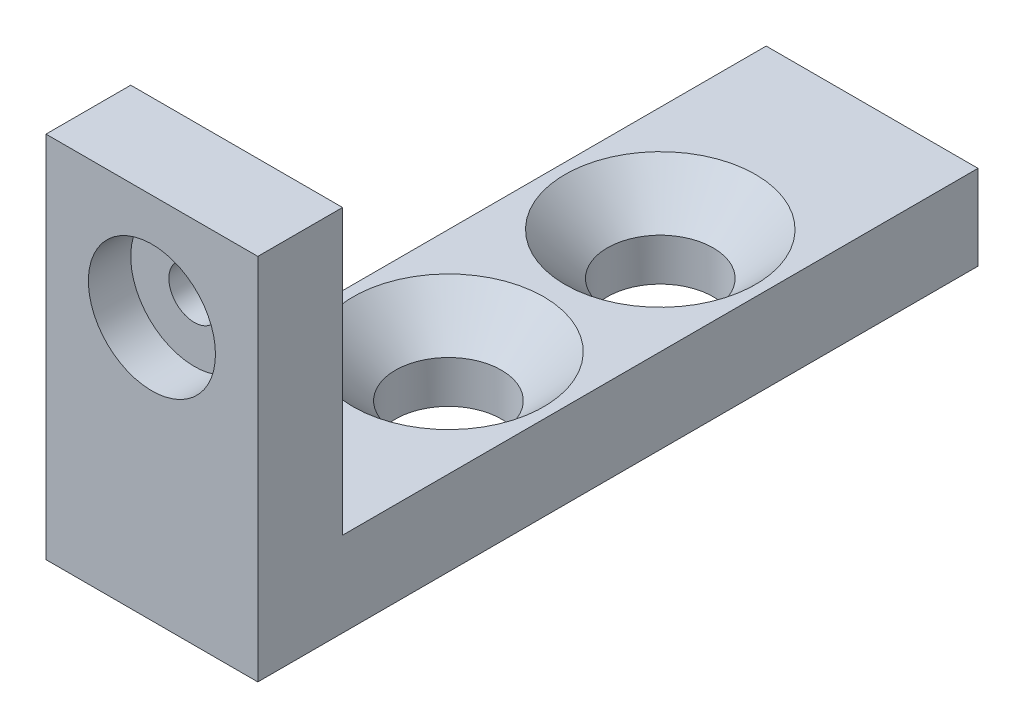
ISO-10303-21;
HEADER;
FILE_DESCRIPTION(('STEP AP214'),'2;1');
FILE_NAME('part.step','',(''),(''),'','','');
FILE_SCHEMA(('AUTOMOTIVE_DESIGN { 1 0 10303 214 1 1 1 1 }'));
ENDSEC;
DATA;
#1=APPLICATION_CONTEXT('core data for automotive mechanical design processes');
#2=APPLICATION_PROTOCOL_DEFINITION('international standard','automotive_design',2000,#1);
#3=PRODUCT_CONTEXT('',#1,'mechanical');
#4=PRODUCT('Part','Part','',(#3));
#5=PRODUCT_RELATED_PRODUCT_CATEGORY('part','',(#4));
#6=PRODUCT_DEFINITION_FORMATION('','',#4);
#7=PRODUCT_DEFINITION_CONTEXT('part definition',#1,'design');
#8=PRODUCT_DEFINITION('design','',#6,#7);
#9=PRODUCT_DEFINITION_SHAPE('','',#8);
#10=(LENGTH_UNIT() NAMED_UNIT(*) SI_UNIT(.MILLI.,.METRE.));
#11=(NAMED_UNIT(*) PLANE_ANGLE_UNIT() SI_UNIT($,.RADIAN.));
#12=(NAMED_UNIT(*) SI_UNIT($,.STERADIAN.) SOLID_ANGLE_UNIT());
#13=UNCERTAINTY_MEASURE_WITH_UNIT(LENGTH_MEASURE(1.E-05),#10,'distance_accuracy_value','');
#14=(GEOMETRIC_REPRESENTATION_CONTEXT(3) GLOBAL_UNCERTAINTY_ASSIGNED_CONTEXT((#13)) GLOBAL_UNIT_ASSIGNED_CONTEXT((#10,
#11,#12)) REPRESENTATION_CONTEXT('',''));
#15=CARTESIAN_POINT('',(0.,0.,0.));
#16=DIRECTION('',(0.,0.,1.));
#17=DIRECTION('',(1.,0.,0.));
#18=AXIS2_PLACEMENT_3D('',#15,#16,#17);
#19=CARTESIAN_POINT('',(2.5,2.5,2.));
#20=DIRECTION('',(1.,0.,0.));
#21=DIRECTION('',(0.,0.,-1.));
#22=AXIS2_PLACEMENT_3D('',#19,#20,#21);
#23=PLANE('',#22);
#24=DIRECTION('',(0.,-1.,0.));
#25=VECTOR('',#24,1.);
#26=CARTESIAN_POINT('',(2.5,2.5,0.));
#27=LINE('',#26,#25);
#28=CARTESIAN_POINT('',(2.5,2.5,0.));
#29=VERTEX_POINT('',#28);
#30=CARTESIAN_POINT('',(2.5,-4.2,0.));
#31=VERTEX_POINT('',#30);
#32=EDGE_CURVE('E131',#29,#31,#27,.T.);
#33=ORIENTED_EDGE('',*,*,#32,.F.);
#34=DIRECTION('',(0.,0.,-1.));
#35=VECTOR('',#34,1.);
#36=CARTESIAN_POINT('',(2.5,2.5,2.));
#37=LINE('',#36,#35);
#38=CARTESIAN_POINT('',(2.5,2.5,2.));
#39=VERTEX_POINT('',#38);
#40=EDGE_CURVE('E56',#39,#29,#37,.T.);
#41=ORIENTED_EDGE('',*,*,#40,.F.);
#42=DIRECTION('',(0.,-1.,0.));
#43=VECTOR('',#42,1.);
#44=CARTESIAN_POINT('',(2.5,2.5,2.));
#45=LINE('',#44,#43);
#46=CARTESIAN_POINT('',(2.5,-6.2,2.));
#47=VERTEX_POINT('',#46);
#48=EDGE_CURVE('E134',#39,#47,#45,.T.);
#49=ORIENTED_EDGE('',*,*,#48,.T.);
#50=DIRECTION('',(0.,0.,-1.));
#51=VECTOR('',#50,1.);
#52=CARTESIAN_POINT('',(2.5,-6.2,2.));
#53=LINE('',#52,#51);
#54=CARTESIAN_POINT('',(2.5,-6.2,-15.));
#55=VERTEX_POINT('',#54);
#56=EDGE_CURVE('E76',#47,#55,#53,.T.);
#57=ORIENTED_EDGE('',*,*,#56,.T.);
#58=DIRECTION('',(0.,-1.,0.));
#59=VECTOR('',#58,1.);
#60=CARTESIAN_POINT('',(2.5,-4.2,-15.));
#61=LINE('',#60,#59);
#62=CARTESIAN_POINT('',(2.5,-4.2,-15.));
#63=VERTEX_POINT('',#62);
#64=EDGE_CURVE('E104',#63,#55,#61,.T.);
#65=ORIENTED_EDGE('',*,*,#64,.F.);
#66=DIRECTION('',(0.,0.,1.));
#67=VECTOR('',#66,1.);
#68=CARTESIAN_POINT('',(2.5,-4.2,-15.));
#69=LINE('',#68,#67);
#70=EDGE_CURVE('E100',#63,#31,#69,.T.);
#71=ORIENTED_EDGE('',*,*,#70,.T.);
#72=EDGE_LOOP('',(#33,#41,#49,#57,#65,#71));
#73=FACE_BOUND('',#72,.T.);
#74=ADVANCED_FACE('F32',(#73),#23,.T.);
#75=CARTESIAN_POINT('',(2.5,2.5,2.));
#76=DIRECTION('',(0.,-1.,0.));
#77=DIRECTION('',(1.,0.,0.));
#78=AXIS2_PLACEMENT_3D('',#75,#76,#77);
#79=PLANE('',#78);
#80=DIRECTION('',(-1.,0.,0.));
#81=VECTOR('',#80,1.);
#82=CARTESIAN_POINT('',(2.5,2.5,0.));
#83=LINE('',#82,#81);
#84=CARTESIAN_POINT('',(-2.5,2.5,0.));
#85=VERTEX_POINT('',#84);
#86=EDGE_CURVE('E137',#29,#85,#83,.T.);
#87=ORIENTED_EDGE('',*,*,#86,.T.);
#88=DIRECTION('',(0.,0.,-1.));
#89=VECTOR('',#88,1.);
#90=CARTESIAN_POINT('',(-2.5,2.5,2.));
#91=LINE('',#90,#89);
#92=CARTESIAN_POINT('',(-2.5,2.5,2.));
#93=VERTEX_POINT('',#92);
#94=EDGE_CURVE('E148',#93,#85,#91,.T.);
#95=ORIENTED_EDGE('',*,*,#94,.F.);
#96=DIRECTION('',(-1.,0.,0.));
#97=VECTOR('',#96,1.);
#98=CARTESIAN_POINT('',(2.5,2.5,2.));
#99=LINE('',#98,#97);
#100=EDGE_CURVE('E141',#39,#93,#99,.T.);
#101=ORIENTED_EDGE('',*,*,#100,.F.);
#102=ORIENTED_EDGE('',*,*,#40,.T.);
#103=EDGE_LOOP('',(#87,#95,#101,#102));
#104=FACE_BOUND('',#103,.T.);
#105=ADVANCED_FACE('F188',(#104),#79,.F.);
#106=CARTESIAN_POINT('',(-2.5,2.5,2.));
#107=DIRECTION('',(1.,0.,0.));
#108=DIRECTION('',(0.,0.,-1.));
#109=AXIS2_PLACEMENT_3D('',#106,#107,#108);
#110=PLANE('',#109);
#111=DIRECTION('',(0.,-1.,0.));
#112=VECTOR('',#111,1.);
#113=CARTESIAN_POINT('',(-2.5,2.5,0.));
#114=LINE('',#113,#112);
#115=CARTESIAN_POINT('',(-2.5,-4.2,0.));
#116=VERTEX_POINT('',#115);
#117=EDGE_CURVE('E116',#85,#116,#114,.T.);
#118=ORIENTED_EDGE('',*,*,#117,.T.);
#119=DIRECTION('',(0.,0.,1.));
#120=VECTOR('',#119,1.);
#121=CARTESIAN_POINT('',(-2.5,-4.2,-15.));
#122=LINE('',#121,#120);
#123=CARTESIAN_POINT('',(-2.5,-4.2,-15.));
#124=VERTEX_POINT('',#123);
#125=EDGE_CURVE('E98',#124,#116,#122,.T.);
#126=ORIENTED_EDGE('',*,*,#125,.F.);
#127=DIRECTION('',(0.,1.,0.));
#128=VECTOR('',#127,1.);
#129=CARTESIAN_POINT('',(-2.5,-4.2,-15.));
#130=LINE('',#129,#128);
#131=CARTESIAN_POINT('',(-2.5,-6.2,-15.));
#132=VERTEX_POINT('',#131);
#133=EDGE_CURVE('E105',#132,#124,#130,.T.);
#134=ORIENTED_EDGE('',*,*,#133,.F.);
#135=DIRECTION('',(0.,0.,-1.));
#136=VECTOR('',#135,1.);
#137=CARTESIAN_POINT('',(-2.5,-6.2,2.));
#138=LINE('',#137,#136);
#139=CARTESIAN_POINT('',(-2.5,-6.2,2.));
#140=VERTEX_POINT('',#139);
#141=EDGE_CURVE('E150',#140,#132,#138,.T.);
#142=ORIENTED_EDGE('',*,*,#141,.F.);
#143=DIRECTION('',(0.,-1.,0.));
#144=VECTOR('',#143,1.);
#145=CARTESIAN_POINT('',(-2.5,2.5,2.));
#146=LINE('',#145,#144);
#147=EDGE_CURVE('E139',#93,#140,#146,.T.);
#148=ORIENTED_EDGE('',*,*,#147,.F.);
#149=ORIENTED_EDGE('',*,*,#94,.T.);
#150=EDGE_LOOP('',(#118,#126,#134,#142,#148,#149));
#151=FACE_BOUND('',#150,.T.);
#152=ADVANCED_FACE('F114',(#151),#110,.F.);
#153=CARTESIAN_POINT('',(2.5,-6.2,2.));
#154=DIRECTION('',(0.,-1.,0.));
#155=DIRECTION('',(0.,0.,-1.));
#156=AXIS2_PLACEMENT_3D('',#153,#154,#155);
#157=PLANE('',#156);
#158=CARTESIAN_POINT('',(0.,-6.2,-10.));
#159=DIRECTION('',(0.,1.,0.));
#160=DIRECTION('',(0.,0.,1.));
#161=AXIS2_PLACEMENT_3D('',#158,#159,#160);
#162=CIRCLE('',#161,1.25);
#163=CARTESIAN_POINT('',(0.,-6.2,-8.75));
#164=VERTEX_POINT('',#163);
#165=EDGE_CURVE('E176',#164,#164,#162,.T.);
#166=ORIENTED_EDGE('',*,*,#165,.T.);
#167=EDGE_LOOP('',(#166));
#168=FACE_BOUND('',#167,.T.);
#169=CARTESIAN_POINT('',(0.,-6.2,-5.));
#170=DIRECTION('',(0.,1.,0.));
#171=DIRECTION('',(0.,0.,1.));
#172=AXIS2_PLACEMENT_3D('',#169,#170,#171);
#173=CIRCLE('',#172,1.25);
#174=CARTESIAN_POINT('',(0.,-6.2,-3.75));
#175=VERTEX_POINT('',#174);
#176=EDGE_CURVE('E174',#175,#175,#173,.T.);
#177=ORIENTED_EDGE('',*,*,#176,.T.);
#178=EDGE_LOOP('',(#177));
#179=FACE_BOUND('',#178,.T.);
#180=ORIENTED_EDGE('',*,*,#141,.T.);
#181=DIRECTION('',(-1.,0.,0.));
#182=VECTOR('',#181,1.);
#183=CARTESIAN_POINT('',(2.5,-6.2,-15.));
#184=LINE('',#183,#182);
#185=EDGE_CURVE('E110',#55,#132,#184,.T.);
#186=ORIENTED_EDGE('',*,*,#185,.F.);
#187=ORIENTED_EDGE('',*,*,#56,.F.);
#188=DIRECTION('',(-1.,0.,0.));
#189=VECTOR('',#188,1.);
#190=CARTESIAN_POINT('',(2.5,-6.2,2.));
#191=LINE('',#190,#189);
#192=EDGE_CURVE('E136',#47,#140,#191,.T.);
#193=ORIENTED_EDGE('',*,*,#192,.T.);
#194=EDGE_LOOP('',(#180,#186,#187,#193));
#195=FACE_BOUND('',#194,.T.);
#196=ADVANCED_FACE('F182',(#168,#179,#195),#157,.T.);
#197=CARTESIAN_POINT('',(0.,0.,2.));
#198=DIRECTION('',(0.,0.,-1.));
#199=DIRECTION('',(-1.,0.,0.));
#200=AXIS2_PLACEMENT_3D('',#197,#198,#199);
#201=PLANE('',#200);
#202=CARTESIAN_POINT('',(0.,0.,2.));
#203=DIRECTION('',(0.,0.,1.));
#204=DIRECTION('',(1.,0.,0.));
#205=AXIS2_PLACEMENT_3D('',#202,#203,#204);
#206=CIRCLE('',#205,1.5);
#207=CARTESIAN_POINT('',(1.5,0.,2.));
#208=VERTEX_POINT('',#207);
#209=EDGE_CURVE('E126',#208,#208,#206,.T.);
#210=ORIENTED_EDGE('',*,*,#209,.F.);
#211=EDGE_LOOP('',(#210));
#212=FACE_BOUND('',#211,.T.);
#213=ORIENTED_EDGE('',*,*,#48,.F.);
#214=ORIENTED_EDGE('',*,*,#100,.T.);
#215=ORIENTED_EDGE('',*,*,#147,.T.);
#216=ORIENTED_EDGE('',*,*,#192,.F.);
#217=EDGE_LOOP('',(#213,#214,#215,#216));
#218=FACE_BOUND('',#217,.T.);
#219=ADVANCED_FACE('F187',(#212,#218),#201,.F.);
#220=CARTESIAN_POINT('',(0.,0.,0.));
#221=DIRECTION('',(0.,0.,-1.));
#222=DIRECTION('',(-1.,0.,0.));
#223=AXIS2_PLACEMENT_3D('',#220,#221,#222);
#224=PLANE('',#223);
#225=DIRECTION('',(1.,0.,0.));
#226=VECTOR('',#225,1.);
#227=CARTESIAN_POINT('',(2.5,-4.2,0.));
#228=LINE('',#227,#226);
#229=EDGE_CURVE('E47',#116,#31,#228,.T.);
#230=ORIENTED_EDGE('',*,*,#229,.F.);
#231=ORIENTED_EDGE('',*,*,#117,.F.);
#232=ORIENTED_EDGE('',*,*,#86,.F.);
#233=ORIENTED_EDGE('',*,*,#32,.T.);
#234=EDGE_LOOP('',(#230,#231,#232,#233));
#235=FACE_BOUND('',#234,.T.);
#236=CARTESIAN_POINT('',(0.,0.,0.));
#237=DIRECTION('',(0.,0.,1.));
#238=DIRECTION('',(1.,0.,0.));
#239=AXIS2_PLACEMENT_3D('',#236,#237,#238);
#240=CIRCLE('',#239,0.6);
#241=CARTESIAN_POINT('',(0.6,0.,0.));
#242=VERTEX_POINT('',#241);
#243=EDGE_CURVE('E120',#242,#242,#240,.T.);
#244=ORIENTED_EDGE('',*,*,#243,.T.);
#245=EDGE_LOOP('',(#244));
#246=FACE_BOUND('',#245,.T.);
#247=ADVANCED_FACE('F189',(#235,#246),#224,.T.);
#248=CARTESIAN_POINT('',(0.,0.,1.));
#249=DIRECTION('',(0.,0.,1.));
#250=DIRECTION('',(1.,0.,0.));
#251=AXIS2_PLACEMENT_3D('',#248,#249,#250);
#252=CYLINDRICAL_SURFACE('',#251,1.5);
#253=CARTESIAN_POINT('',(0.,0.,1.));
#254=DIRECTION('',(0.,0.,1.));
#255=DIRECTION('',(1.,0.,0.));
#256=AXIS2_PLACEMENT_3D('',#253,#254,#255);
#257=CIRCLE('',#256,1.5);
#258=CARTESIAN_POINT('',(1.5,0.,1.));
#259=VERTEX_POINT('',#258);
#260=EDGE_CURVE('E128',#259,#259,#257,.T.);
#261=ORIENTED_EDGE('',*,*,#260,.F.);
#262=EDGE_LOOP('',(#261));
#263=FACE_BOUND('',#262,.T.);
#264=ORIENTED_EDGE('',*,*,#209,.T.);
#265=EDGE_LOOP('',(#264));
#266=FACE_BOUND('',#265,.T.);
#267=ADVANCED_FACE('F192',(#263,#266),#252,.F.);
#268=CARTESIAN_POINT('',(0.,0.,1.));
#269=DIRECTION('',(0.,0.,1.));
#270=DIRECTION('',(1.,0.,0.));
#271=AXIS2_PLACEMENT_3D('',#268,#269,#270);
#272=PLANE('',#271);
#273=CARTESIAN_POINT('',(0.,0.,1.));
#274=DIRECTION('',(0.,0.,1.));
#275=DIRECTION('',(1.,0.,0.));
#276=AXIS2_PLACEMENT_3D('',#273,#274,#275);
#277=CIRCLE('',#276,0.6);
#278=CARTESIAN_POINT('',(0.6,0.,1.));
#279=VERTEX_POINT('',#278);
#280=EDGE_CURVE('E117',#279,#279,#277,.T.);
#281=ORIENTED_EDGE('',*,*,#280,.F.);
#282=EDGE_LOOP('',(#281));
#283=FACE_BOUND('',#282,.T.);
#284=ORIENTED_EDGE('',*,*,#260,.T.);
#285=EDGE_LOOP('',(#284));
#286=FACE_BOUND('',#285,.T.);
#287=ADVANCED_FACE('F199',(#283,#286),#272,.T.);
#288=CARTESIAN_POINT('',(0.,0.,0.));
#289=DIRECTION('',(0.,0.,1.));
#290=DIRECTION('',(1.,0.,0.));
#291=AXIS2_PLACEMENT_3D('',#288,#289,#290);
#292=CYLINDRICAL_SURFACE('',#291,0.6);
#293=ORIENTED_EDGE('',*,*,#243,.F.);
#294=EDGE_LOOP('',(#293));
#295=FACE_BOUND('',#294,.T.);
#296=ORIENTED_EDGE('',*,*,#280,.T.);
#297=EDGE_LOOP('',(#296));
#298=FACE_BOUND('',#297,.T.);
#299=ADVANCED_FACE('F196',(#295,#298),#292,.F.);
#300=CARTESIAN_POINT('',(2.5,-4.2,-15.));
#301=DIRECTION('',(0.,-1.,0.));
#302=DIRECTION('',(0.,0.,-1.));
#303=AXIS2_PLACEMENT_3D('',#300,#301,#302);
#304=PLANE('',#303);
#305=CARTESIAN_POINT('',(0.,-4.2,-5.));
#306=DIRECTION('',(0.,-1.,0.));
#307=DIRECTION('',(0.,0.,-1.));
#308=AXIS2_PLACEMENT_3D('',#305,#306,#307);
#309=CIRCLE('',#308,2.25000000000001);
#310=CARTESIAN_POINT('',(0.,-4.2,-7.25000000000001));
#311=VERTEX_POINT('',#310);
#312=EDGE_CURVE('E40',#311,#311,#309,.T.);
#313=ORIENTED_EDGE('',*,*,#312,.T.);
#314=EDGE_LOOP('',(#313));
#315=FACE_BOUND('',#314,.T.);
#316=CARTESIAN_POINT('',(0.,-4.2,-10.));
#317=DIRECTION('',(0.,-1.,0.));
#318=DIRECTION('',(0.,0.,-1.));
#319=AXIS2_PLACEMENT_3D('',#316,#317,#318);
#320=CIRCLE('',#319,2.25000000000001);
#321=CARTESIAN_POINT('',(0.,-4.2,-12.25));
#322=VERTEX_POINT('',#321);
#323=EDGE_CURVE('E155',#322,#322,#320,.T.);
#324=ORIENTED_EDGE('',*,*,#323,.T.);
#325=EDGE_LOOP('',(#324));
#326=FACE_BOUND('',#325,.T.);
#327=ORIENTED_EDGE('',*,*,#229,.T.);
#328=ORIENTED_EDGE('',*,*,#70,.F.);
#329=DIRECTION('',(1.,0.,0.));
#330=VECTOR('',#329,1.);
#331=CARTESIAN_POINT('',(2.5,-4.2,-15.));
#332=LINE('',#331,#330);
#333=EDGE_CURVE('E94',#124,#63,#332,.T.);
#334=ORIENTED_EDGE('',*,*,#333,.F.);
#335=ORIENTED_EDGE('',*,*,#125,.T.);
#336=EDGE_LOOP('',(#327,#328,#334,#335));
#337=FACE_BOUND('',#336,.T.);
#338=ADVANCED_FACE('F96',(#315,#326,#337),#304,.F.);
#339=CARTESIAN_POINT('',(0.,0.,-15.));
#340=DIRECTION('',(0.,0.,-1.));
#341=DIRECTION('',(-1.,0.,0.));
#342=AXIS2_PLACEMENT_3D('',#339,#340,#341);
#343=PLANE('',#342);
#344=ORIENTED_EDGE('',*,*,#133,.T.);
#345=ORIENTED_EDGE('',*,*,#333,.T.);
#346=ORIENTED_EDGE('',*,*,#64,.T.);
#347=ORIENTED_EDGE('',*,*,#185,.T.);
#348=EDGE_LOOP('',(#344,#345,#346,#347));
#349=FACE_BOUND('',#348,.T.);
#350=ADVANCED_FACE('F109',(#349),#343,.T.);
#351=CARTESIAN_POINT('',(0.,-6.2,-5.));
#352=DIRECTION('',(0.,1.,0.));
#353=DIRECTION('',(0.,0.,1.));
#354=AXIS2_PLACEMENT_3D('',#351,#352,#353);
#355=CYLINDRICAL_SURFACE('',#354,1.25);
#356=CARTESIAN_POINT('',(0.,-5.2,-5.));
#357=DIRECTION('',(0.,-1.,0.));
#358=DIRECTION('',(0.,0.,-1.));
#359=AXIS2_PLACEMENT_3D('',#356,#357,#358);
#360=CIRCLE('',#359,1.25);
#361=CARTESIAN_POINT('',(0.,-5.2,-6.25));
#362=VERTEX_POINT('',#361);
#363=EDGE_CURVE('E147',#362,#362,#360,.F.);
#364=ORIENTED_EDGE('',*,*,#363,.T.);
#365=EDGE_LOOP('',(#364));
#366=FACE_BOUND('',#365,.T.);
#367=ORIENTED_EDGE('',*,*,#176,.F.);
#368=EDGE_LOOP('',(#367));
#369=FACE_BOUND('',#368,.T.);
#370=ADVANCED_FACE('F168',(#366,#369),#355,.F.);
#371=CARTESIAN_POINT('',(0.,-6.2,-10.));
#372=DIRECTION('',(0.,1.,0.));
#373=DIRECTION('',(0.,0.,1.));
#374=AXIS2_PLACEMENT_3D('',#371,#372,#373);
#375=CYLINDRICAL_SURFACE('',#374,1.25);
#376=CARTESIAN_POINT('',(0.,-5.2,-10.));
#377=DIRECTION('',(0.,-1.,0.));
#378=DIRECTION('',(0.,0.,-1.));
#379=AXIS2_PLACEMENT_3D('',#376,#377,#378);
#380=CIRCLE('',#379,1.25);
#381=CARTESIAN_POINT('',(0.,-5.2,-11.25));
#382=VERTEX_POINT('',#381);
#383=EDGE_CURVE('E11',#382,#382,#380,.F.);
#384=ORIENTED_EDGE('',*,*,#383,.T.);
#385=EDGE_LOOP('',(#384));
#386=FACE_BOUND('',#385,.T.);
#387=ORIENTED_EDGE('',*,*,#165,.F.);
#388=EDGE_LOOP('',(#387));
#389=FACE_BOUND('',#388,.T.);
#390=ADVANCED_FACE('F165',(#386,#389),#375,.F.);
#391=CARTESIAN_POINT('',(0.,-5.2,-5.));
#392=DIRECTION('',(0.,1.,0.));
#393=DIRECTION('',(0.,0.,1.));
#394=AXIS2_PLACEMENT_3D('',#391,#392,#393);
#395=CONICAL_SURFACE('',#394,1.25,0.78539816339745);
#396=ORIENTED_EDGE('',*,*,#312,.F.);
#397=EDGE_LOOP('',(#396));
#398=FACE_BOUND('',#397,.T.);
#399=ORIENTED_EDGE('',*,*,#363,.F.);
#400=EDGE_LOOP('',(#399));
#401=FACE_BOUND('',#400,.T.);
#402=ADVANCED_FACE('F162',(#398,#401),#395,.F.);
#403=CARTESIAN_POINT('',(0.,-5.2,-10.));
#404=DIRECTION('',(0.,1.,0.));
#405=DIRECTION('',(0.,0.,1.));
#406=AXIS2_PLACEMENT_3D('',#403,#404,#405);
#407=CONICAL_SURFACE('',#406,1.25,0.785398163397451);
#408=ORIENTED_EDGE('',*,*,#323,.F.);
#409=EDGE_LOOP('',(#408));
#410=FACE_BOUND('',#409,.T.);
#411=ORIENTED_EDGE('',*,*,#383,.F.);
#412=EDGE_LOOP('',(#411));
#413=FACE_BOUND('',#412,.T.);
#414=ADVANCED_FACE('F34',(#410,#413),#407,.F.);
#415=CLOSED_SHELL('',(#74,#105,#152,#196,#219,#247,#267,#287,#299,#338,#350,#370,#390,#402,#414));
#416=MANIFOLD_SOLID_BREP('B2',#415);
#417=ADVANCED_BREP_SHAPE_REPRESENTATION('',(#18,#416),#14);
#418=SHAPE_DEFINITION_REPRESENTATION(#9,#417);
ENDSEC;
END-ISO-10303-21;
